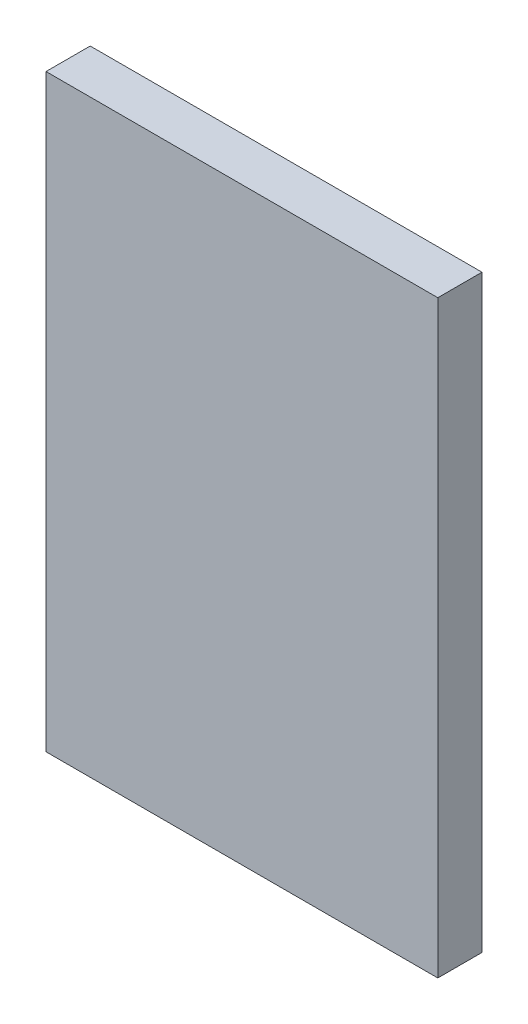
ISO-10303-21;
HEADER;
FILE_DESCRIPTION(('STEP AP214'),'2;1');
FILE_NAME('part.step','',(''),(''),'','','');
FILE_SCHEMA(('AUTOMOTIVE_DESIGN { 1 0 10303 214 1 1 1 1 }'));
ENDSEC;
DATA;
#1=APPLICATION_CONTEXT('core data for automotive mechanical design processes');
#2=APPLICATION_PROTOCOL_DEFINITION('international standard','automotive_design',2000,#1);
#3=PRODUCT_CONTEXT('',#1,'mechanical');
#4=PRODUCT('Part','Part','',(#3));
#5=PRODUCT_RELATED_PRODUCT_CATEGORY('part','',(#4));
#6=PRODUCT_DEFINITION_FORMATION('','',#4);
#7=PRODUCT_DEFINITION_CONTEXT('part definition',#1,'design');
#8=PRODUCT_DEFINITION('design','',#6,#7);
#9=PRODUCT_DEFINITION_SHAPE('','',#8);
#10=(LENGTH_UNIT() NAMED_UNIT(*) SI_UNIT(.MILLI.,.METRE.));
#11=(NAMED_UNIT(*) PLANE_ANGLE_UNIT() SI_UNIT($,.RADIAN.));
#12=(NAMED_UNIT(*) SI_UNIT($,.STERADIAN.) SOLID_ANGLE_UNIT());
#13=UNCERTAINTY_MEASURE_WITH_UNIT(LENGTH_MEASURE(1.E-05),#10,'distance_accuracy_value','');
#14=(GEOMETRIC_REPRESENTATION_CONTEXT(3) GLOBAL_UNCERTAINTY_ASSIGNED_CONTEXT((#13)) GLOBAL_UNIT_ASSIGNED_CONTEXT((#10,
#11,#12)) REPRESENTATION_CONTEXT('',''));
#15=CARTESIAN_POINT('',(0.,0.,0.));
#16=DIRECTION('',(0.,0.,1.));
#17=DIRECTION('',(1.,0.,0.));
#18=AXIS2_PLACEMENT_3D('',#15,#16,#17);
#19=CARTESIAN_POINT('',(0.,0.,150.));
#20=DIRECTION('',(1.,0.,0.));
#21=DIRECTION('',(0.,0.,-1.));
#22=AXIS2_PLACEMENT_3D('',#19,#20,#21);
#23=PLANE('',#22);
#24=DIRECTION('',(0.,-1.,0.));
#25=VECTOR('',#24,1.);
#26=CARTESIAN_POINT('',(0.,0.,0.));
#27=LINE('',#26,#25);
#28=CARTESIAN_POINT('',(0.,0.,0.));
#29=VERTEX_POINT('',#28);
#30=CARTESIAN_POINT('',(0.,-2000.,0.));
#31=VERTEX_POINT('',#30);
#32=EDGE_CURVE('E99',#29,#31,#27,.T.);
#33=ORIENTED_EDGE('',*,*,#32,.T.);
#34=DIRECTION('',(0.,0.,-1.));
#35=VECTOR('',#34,1.);
#36=CARTESIAN_POINT('',(0.,-2000.,150.));
#37=LINE('',#36,#35);
#38=CARTESIAN_POINT('',(0.,-2000.,150.));
#39=VERTEX_POINT('',#38);
#40=EDGE_CURVE('E11',#39,#31,#37,.T.);
#41=ORIENTED_EDGE('',*,*,#40,.F.);
#42=DIRECTION('',(0.,-1.,0.));
#43=VECTOR('',#42,1.);
#44=CARTESIAN_POINT('',(0.,0.,150.));
#45=LINE('',#44,#43);
#46=CARTESIAN_POINT('',(0.,0.,150.));
#47=VERTEX_POINT('',#46);
#48=EDGE_CURVE('E87',#47,#39,#45,.T.);
#49=ORIENTED_EDGE('',*,*,#48,.F.);
#50=DIRECTION('',(0.,0.,-1.));
#51=VECTOR('',#50,1.);
#52=CARTESIAN_POINT('',(0.,0.,150.));
#53=LINE('',#52,#51);
#54=EDGE_CURVE('E95',#47,#29,#53,.T.);
#55=ORIENTED_EDGE('',*,*,#54,.T.);
#56=EDGE_LOOP('',(#33,#41,#49,#55));
#57=FACE_BOUND('',#56,.T.);
#58=ADVANCED_FACE('F36',(#57),#23,.F.);
#59=CARTESIAN_POINT('',(0.,-2000.,150.));
#60=DIRECTION('',(0.,1.,0.));
#61=DIRECTION('',(0.,0.,1.));
#62=AXIS2_PLACEMENT_3D('',#59,#60,#61);
#63=PLANE('',#62);
#64=DIRECTION('',(1.,0.,0.));
#65=VECTOR('',#64,1.);
#66=CARTESIAN_POINT('',(0.,-2000.,0.));
#67=LINE('',#66,#65);
#68=CARTESIAN_POINT('',(1330.,-2000.,0.));
#69=VERTEX_POINT('',#68);
#70=EDGE_CURVE('E91',#31,#69,#67,.T.);
#71=ORIENTED_EDGE('',*,*,#70,.T.);
#72=DIRECTION('',(0.,0.,-1.));
#73=VECTOR('',#72,1.);
#74=CARTESIAN_POINT('',(1330.,-2000.,150.));
#75=LINE('',#74,#73);
#76=CARTESIAN_POINT('',(1330.,-2000.,150.));
#77=VERTEX_POINT('',#76);
#78=EDGE_CURVE('E44',#77,#69,#75,.T.);
#79=ORIENTED_EDGE('',*,*,#78,.F.);
#80=DIRECTION('',(1.,0.,0.));
#81=VECTOR('',#80,1.);
#82=CARTESIAN_POINT('',(0.,-2000.,150.));
#83=LINE('',#82,#81);
#84=EDGE_CURVE('E82',#39,#77,#83,.T.);
#85=ORIENTED_EDGE('',*,*,#84,.F.);
#86=ORIENTED_EDGE('',*,*,#40,.T.);
#87=EDGE_LOOP('',(#71,#79,#85,#86));
#88=FACE_BOUND('',#87,.T.);
#89=ADVANCED_FACE('F90',(#88),#63,.F.);
#90=CARTESIAN_POINT('',(1330.,0.,150.));
#91=DIRECTION('',(-1.,0.,0.));
#92=DIRECTION('',(0.,-1.,0.));
#93=AXIS2_PLACEMENT_3D('',#90,#91,#92);
#94=PLANE('',#93);
#95=DIRECTION('',(0.,1.,0.));
#96=VECTOR('',#95,1.);
#97=CARTESIAN_POINT('',(1330.,0.,0.));
#98=LINE('',#97,#96);
#99=CARTESIAN_POINT('',(1330.,0.,0.));
#100=VERTEX_POINT('',#99);
#101=EDGE_CURVE('E69',#69,#100,#98,.T.);
#102=ORIENTED_EDGE('',*,*,#101,.T.);
#103=DIRECTION('',(0.,0.,-1.));
#104=VECTOR('',#103,1.);
#105=CARTESIAN_POINT('',(1330.,0.,150.));
#106=LINE('',#105,#104);
#107=CARTESIAN_POINT('',(1330.,0.,150.));
#108=VERTEX_POINT('',#107);
#109=EDGE_CURVE('E92',#108,#100,#106,.T.);
#110=ORIENTED_EDGE('',*,*,#109,.F.);
#111=DIRECTION('',(0.,1.,0.));
#112=VECTOR('',#111,1.);
#113=CARTESIAN_POINT('',(1330.,0.,150.));
#114=LINE('',#113,#112);
#115=EDGE_CURVE('E85',#77,#108,#114,.T.);
#116=ORIENTED_EDGE('',*,*,#115,.F.);
#117=ORIENTED_EDGE('',*,*,#78,.T.);
#118=EDGE_LOOP('',(#102,#110,#116,#117));
#119=FACE_BOUND('',#118,.T.);
#120=ADVANCED_FACE('F93',(#119),#94,.F.);
#121=CARTESIAN_POINT('',(0.,0.,150.));
#122=DIRECTION('',(0.,-1.,0.));
#123=DIRECTION('',(0.,0.,-1.));
#124=AXIS2_PLACEMENT_3D('',#121,#122,#123);
#125=PLANE('',#124);
#126=DIRECTION('',(-1.,0.,0.));
#127=VECTOR('',#126,1.);
#128=CARTESIAN_POINT('',(0.,0.,0.));
#129=LINE('',#128,#127);
#130=EDGE_CURVE('E75',#100,#29,#129,.T.);
#131=ORIENTED_EDGE('',*,*,#130,.T.);
#132=ORIENTED_EDGE('',*,*,#54,.F.);
#133=DIRECTION('',(-1.,0.,0.));
#134=VECTOR('',#133,1.);
#135=CARTESIAN_POINT('',(0.,0.,150.));
#136=LINE('',#135,#134);
#137=EDGE_CURVE('E52',#108,#47,#136,.T.);
#138=ORIENTED_EDGE('',*,*,#137,.F.);
#139=ORIENTED_EDGE('',*,*,#109,.T.);
#140=EDGE_LOOP('',(#131,#132,#138,#139));
#141=FACE_BOUND('',#140,.T.);
#142=ADVANCED_FACE('F106',(#141),#125,.F.);
#143=CARTESIAN_POINT('',(0.,0.,150.));
#144=DIRECTION('',(0.,0.,1.));
#145=DIRECTION('',(1.,0.,0.));
#146=AXIS2_PLACEMENT_3D('',#143,#144,#145);
#147=PLANE('',#146);
#148=ORIENTED_EDGE('',*,*,#48,.T.);
#149=ORIENTED_EDGE('',*,*,#84,.T.);
#150=ORIENTED_EDGE('',*,*,#115,.T.);
#151=ORIENTED_EDGE('',*,*,#137,.T.);
#152=EDGE_LOOP('',(#148,#149,#150,#151));
#153=FACE_BOUND('',#152,.T.);
#154=ADVANCED_FACE('F83',(#153),#147,.T.);
#155=CARTESIAN_POINT('',(0.,0.,0.));
#156=DIRECTION('',(0.,0.,1.));
#157=DIRECTION('',(1.,0.,0.));
#158=AXIS2_PLACEMENT_3D('',#155,#156,#157);
#159=PLANE('',#158);
#160=ORIENTED_EDGE('',*,*,#32,.F.);
#161=ORIENTED_EDGE('',*,*,#130,.F.);
#162=ORIENTED_EDGE('',*,*,#101,.F.);
#163=ORIENTED_EDGE('',*,*,#70,.F.);
#164=EDGE_LOOP('',(#160,#161,#162,#163));
#165=FACE_BOUND('',#164,.T.);
#166=ADVANCED_FACE('F109',(#165),#159,.F.);
#167=CLOSED_SHELL('',(#58,#89,#120,#142,#154,#166));
#168=MANIFOLD_SOLID_BREP('B2',#167);
#169=ADVANCED_BREP_SHAPE_REPRESENTATION('',(#18,#168),#14);
#170=SHAPE_DEFINITION_REPRESENTATION(#9,#169);
ENDSEC;
END-ISO-10303-21;
